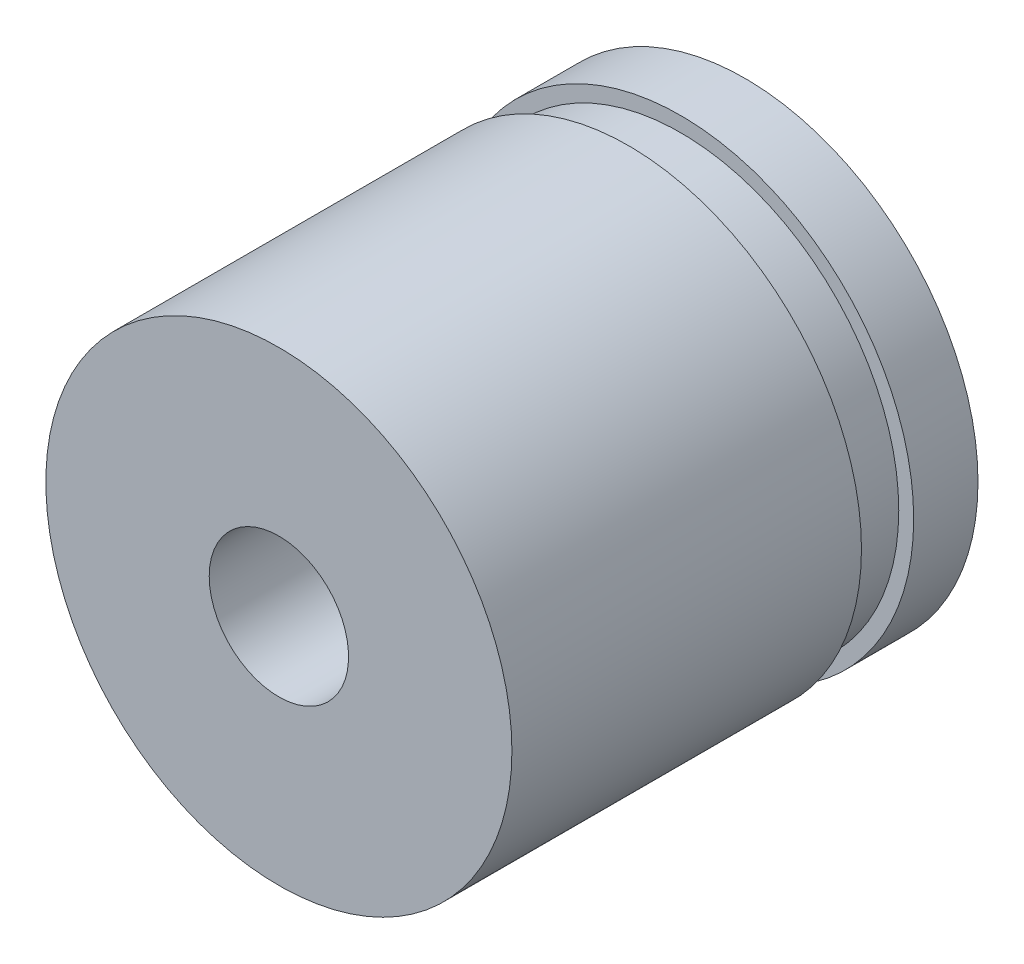
ISO-10303-21;
HEADER;
FILE_DESCRIPTION(('STEP AP214'),'2;1');
FILE_NAME('part.step','',(''),(''),'','','');
FILE_SCHEMA(('AUTOMOTIVE_DESIGN { 1 0 10303 214 1 1 1 1 }'));
ENDSEC;
DATA;
#1=APPLICATION_CONTEXT('core data for automotive mechanical design processes');
#2=APPLICATION_PROTOCOL_DEFINITION('international standard','automotive_design',2000,#1);
#3=PRODUCT_CONTEXT('',#1,'mechanical');
#4=PRODUCT('Part','Part','',(#3));
#5=PRODUCT_RELATED_PRODUCT_CATEGORY('part','',(#4));
#6=PRODUCT_DEFINITION_FORMATION('','',#4);
#7=PRODUCT_DEFINITION_CONTEXT('part definition',#1,'design');
#8=PRODUCT_DEFINITION('design','',#6,#7);
#9=PRODUCT_DEFINITION_SHAPE('','',#8);
#10=(LENGTH_UNIT() NAMED_UNIT(*) SI_UNIT(.MILLI.,.METRE.));
#11=(NAMED_UNIT(*) PLANE_ANGLE_UNIT() SI_UNIT($,.RADIAN.));
#12=(NAMED_UNIT(*) SI_UNIT($,.STERADIAN.) SOLID_ANGLE_UNIT());
#13=UNCERTAINTY_MEASURE_WITH_UNIT(LENGTH_MEASURE(1.E-05),#10,'distance_accuracy_value','');
#14=(GEOMETRIC_REPRESENTATION_CONTEXT(3) GLOBAL_UNCERTAINTY_ASSIGNED_CONTEXT((#13)) GLOBAL_UNIT_ASSIGNED_CONTEXT((#10,
#11,#12)) REPRESENTATION_CONTEXT('',''));
#15=CARTESIAN_POINT('',(0.,0.,0.));
#16=DIRECTION('',(0.,0.,1.));
#17=DIRECTION('',(1.,0.,0.));
#18=AXIS2_PLACEMENT_3D('',#15,#16,#17);
#19=CARTESIAN_POINT('',(-94.293901082123,0.,32.69234));
#20=DIRECTION('',(0.,0.,1.));
#21=DIRECTION('',(1.,0.,0.));
#22=AXIS2_PLACEMENT_3D('',#19,#20,#21);
#23=CYLINDRICAL_SURFACE('',#22,6.35);
#24=CARTESIAN_POINT('',(-94.293901082123,0.,32.69234));
#25=DIRECTION('',(0.,0.,1.));
#26=DIRECTION('',(1.,0.,0.));
#27=AXIS2_PLACEMENT_3D('',#24,#25,#26);
#28=CIRCLE('',#27,6.35);
#29=CARTESIAN_POINT('',(-87.943901082123,0.,32.69234));
#30=VERTEX_POINT('',#29);
#31=EDGE_CURVE('E10',#30,#30,#28,.T.);
#32=ORIENTED_EDGE('',*,*,#31,.T.);
#33=EDGE_LOOP('',(#32));
#34=FACE_BOUND('',#33,.T.);
#35=CARTESIAN_POINT('',(-94.293901082123,0.,34.44494));
#36=DIRECTION('',(0.,0.,1.));
#37=DIRECTION('',(1.,0.,0.));
#38=AXIS2_PLACEMENT_3D('',#35,#36,#37);
#39=CIRCLE('',#38,6.35);
#40=CARTESIAN_POINT('',(-87.943901082123,0.,34.44494));
#41=VERTEX_POINT('',#40);
#42=EDGE_CURVE('E52',#41,#41,#39,.T.);
#43=ORIENTED_EDGE('',*,*,#42,.F.);
#44=EDGE_LOOP('',(#43));
#45=FACE_BOUND('',#44,.T.);
#46=ADVANCED_FACE('F37',(#34,#45),#23,.T.);
#47=CARTESIAN_POINT('',(-94.293901082123,0.,32.69234));
#48=DIRECTION('',(0.,0.,1.));
#49=DIRECTION('',(1.,0.,0.));
#50=AXIS2_PLACEMENT_3D('',#47,#48,#49);
#51=PLANE('',#50);
#52=ORIENTED_EDGE('',*,*,#31,.F.);
#53=EDGE_LOOP('',(#52));
#54=FACE_BOUND('',#53,.T.);
#55=ADVANCED_FACE('F86',(#54),#51,.F.);
#56=CARTESIAN_POINT('',(-94.293901082123,0.,34.44494));
#57=DIRECTION('',(0.,0.,1.));
#58=DIRECTION('',(1.,0.,0.));
#59=AXIS2_PLACEMENT_3D('',#56,#57,#58);
#60=PLANE('',#59);
#61=ORIENTED_EDGE('',*,*,#42,.T.);
#62=EDGE_LOOP('',(#61));
#63=FACE_BOUND('',#62,.T.);
#64=CARTESIAN_POINT('',(-94.293901082123,0.,34.44494));
#65=DIRECTION('',(0.,0.,1.));
#66=DIRECTION('',(1.,0.,0.));
#67=AXIS2_PLACEMENT_3D('',#64,#65,#66);
#68=CIRCLE('',#67,5.94359999999999);
#69=CARTESIAN_POINT('',(-88.350301082123,0.,34.44494));
#70=VERTEX_POINT('',#69);
#71=EDGE_CURVE('E58',#70,#70,#68,.T.);
#72=ORIENTED_EDGE('',*,*,#71,.F.);
#73=EDGE_LOOP('',(#72));
#74=FACE_BOUND('',#73,.T.);
#75=ADVANCED_FACE('F91',(#63,#74),#60,.T.);
#76=CARTESIAN_POINT('',(-94.293901082123,0.,53.8278522421383));
#77=DIRECTION('',(0.,0.,-1.));
#78=DIRECTION('',(-1.,0.,0.));
#79=AXIS2_PLACEMENT_3D('',#76,#77,#78);
#80=CYLINDRICAL_SURFACE('',#79,5.94359999999999);
#81=ORIENTED_EDGE('',*,*,#71,.T.);
#82=EDGE_LOOP('',(#81));
#83=FACE_BOUND('',#82,.T.);
#84=CARTESIAN_POINT('',(-94.293901082123,0.,35.86734));
#85=DIRECTION('',(0.,0.,1.));
#86=DIRECTION('',(1.,0.,0.));
#87=AXIS2_PLACEMENT_3D('',#84,#85,#86);
#88=CIRCLE('',#87,5.94359999999999);
#89=CARTESIAN_POINT('',(-88.350301082123,0.,35.86734));
#90=VERTEX_POINT('',#89);
#91=EDGE_CURVE('E55',#90,#90,#88,.T.);
#92=ORIENTED_EDGE('',*,*,#91,.F.);
#93=EDGE_LOOP('',(#92));
#94=FACE_BOUND('',#93,.T.);
#95=ADVANCED_FACE('F97',(#83,#94),#80,.T.);
#96=CARTESIAN_POINT('',(0.,0.,35.86734));
#97=DIRECTION('',(0.,0.,1.));
#98=DIRECTION('',(1.,0.,0.));
#99=AXIS2_PLACEMENT_3D('',#96,#97,#98);
#100=PLANE('',#99);
#101=ORIENTED_EDGE('',*,*,#91,.T.);
#102=EDGE_LOOP('',(#101));
#103=FACE_BOUND('',#102,.T.);
#104=CARTESIAN_POINT('',(-94.293901082123,0.,35.86734));
#105=DIRECTION('',(0.,0.,1.));
#106=DIRECTION('',(1.,0.,0.));
#107=AXIS2_PLACEMENT_3D('',#104,#105,#106);
#108=CIRCLE('',#107,6.35);
#109=CARTESIAN_POINT('',(-87.943901082123,0.,35.86734));
#110=VERTEX_POINT('',#109);
#111=EDGE_CURVE('E48',#110,#110,#108,.T.);
#112=ORIENTED_EDGE('',*,*,#111,.F.);
#113=EDGE_LOOP('',(#112));
#114=FACE_BOUND('',#113,.T.);
#115=ADVANCED_FACE('F103',(#103,#114),#100,.F.);
#116=CARTESIAN_POINT('',(-94.293901082123,0.,45.39234));
#117=DIRECTION('',(0.,0.,1.));
#118=DIRECTION('',(1.,0.,0.));
#119=AXIS2_PLACEMENT_3D('',#116,#117,#118);
#120=PLANE('',#119);
#121=CARTESIAN_POINT('',(-94.293901082123,0.,45.39234));
#122=DIRECTION('',(0.,0.,-1.));
#123=DIRECTION('',(-1.,0.,0.));
#124=AXIS2_PLACEMENT_3D('',#121,#122,#123);
#125=CIRCLE('',#124,1.89865);
#126=CARTESIAN_POINT('',(-96.192551082123,0.,45.39234));
#127=VERTEX_POINT('',#126);
#128=EDGE_CURVE('E59',#127,#127,#125,.T.);
#129=ORIENTED_EDGE('',*,*,#128,.T.);
#130=EDGE_LOOP('',(#129));
#131=FACE_BOUND('',#130,.T.);
#132=CARTESIAN_POINT('',(-94.293901082123,0.,45.39234));
#133=DIRECTION('',(0.,0.,1.));
#134=DIRECTION('',(1.,0.,0.));
#135=AXIS2_PLACEMENT_3D('',#132,#133,#134);
#136=CIRCLE('',#135,6.35);
#137=CARTESIAN_POINT('',(-87.943901082123,0.,45.39234));
#138=VERTEX_POINT('',#137);
#139=EDGE_CURVE('E44',#138,#138,#136,.T.);
#140=ORIENTED_EDGE('',*,*,#139,.T.);
#141=EDGE_LOOP('',(#140));
#142=FACE_BOUND('',#141,.T.);
#143=ADVANCED_FACE('F82',(#131,#142),#120,.T.);
#144=ORIENTED_EDGE('',*,*,#111,.T.);
#145=EDGE_LOOP('',(#144));
#146=FACE_BOUND('',#145,.T.);
#147=ORIENTED_EDGE('',*,*,#139,.F.);
#148=EDGE_LOOP('',(#147));
#149=FACE_BOUND('',#148,.T.);
#150=ADVANCED_FACE('F39',(#146,#149),#23,.T.);
#151=CARTESIAN_POINT('',(-92.395251082123,0.,39.04234));
#152=DIRECTION('',(0.,0.,-1.));
#153=DIRECTION('',(-1.,0.,0.));
#154=AXIS2_PLACEMENT_3D('',#151,#152,#153);
#155=PLANE('',#154);
#156=CARTESIAN_POINT('',(-94.293901082123,0.,39.04234));
#157=DIRECTION('',(0.,0.,-1.));
#158=DIRECTION('',(-1.,0.,0.));
#159=AXIS2_PLACEMENT_3D('',#156,#157,#158);
#160=CIRCLE('',#159,1.89864999999999);
#161=CARTESIAN_POINT('',(-96.1925510821229,0.,39.04234));
#162=VERTEX_POINT('',#161);
#163=EDGE_CURVE('E66',#162,#162,#160,.T.);
#164=ORIENTED_EDGE('',*,*,#163,.F.);
#165=EDGE_LOOP('',(#164));
#166=FACE_BOUND('',#165,.T.);
#167=ADVANCED_FACE('F72',(#166),#155,.F.);
#168=CARTESIAN_POINT('',(-94.293901082123,0.,39.04234));
#169=DIRECTION('',(0.,0.,-1.));
#170=DIRECTION('',(-1.,0.,0.));
#171=AXIS2_PLACEMENT_3D('',#168,#169,#170);
#172=CYLINDRICAL_SURFACE('',#171,1.89864999999999);
#173=ORIENTED_EDGE('',*,*,#128,.F.);
#174=EDGE_LOOP('',(#173));
#175=FACE_BOUND('',#174,.T.);
#176=ORIENTED_EDGE('',*,*,#163,.T.);
#177=EDGE_LOOP('',(#176));
#178=FACE_BOUND('',#177,.T.);
#179=ADVANCED_FACE('F70',(#175,#178),#172,.F.);
#180=CLOSED_SHELL('',(#46,#55,#75,#95,#115,#143,#150,#167,#179));
#181=MANIFOLD_SOLID_BREP('B2',#180);
#182=ADVANCED_BREP_SHAPE_REPRESENTATION('',(#18,#181),#14);
#183=SHAPE_DEFINITION_REPRESENTATION(#9,#182);
ENDSEC;
END-ISO-10303-21;
